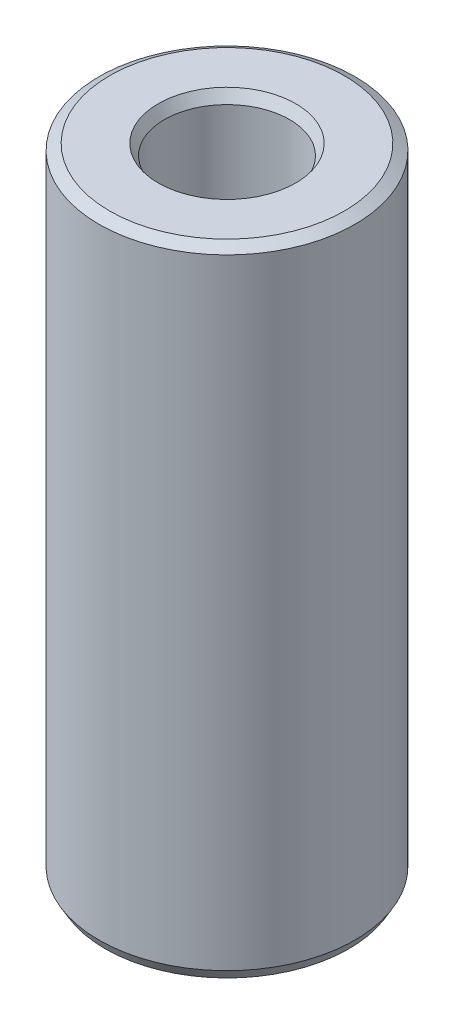
ISO-10303-21;
HEADER;
FILE_DESCRIPTION(('STEP AP214'),'2;1');
FILE_NAME('part.step','',(''),(''),'','','');
FILE_SCHEMA(('AUTOMOTIVE_DESIGN { 1 0 10303 214 1 1 1 1 }'));
ENDSEC;
DATA;
#1=APPLICATION_CONTEXT('core data for automotive mechanical design processes');
#2=APPLICATION_PROTOCOL_DEFINITION('international standard','automotive_design',2000,#1);
#3=PRODUCT_CONTEXT('',#1,'mechanical');
#4=PRODUCT('Part','Part','',(#3));
#5=PRODUCT_RELATED_PRODUCT_CATEGORY('part','',(#4));
#6=PRODUCT_DEFINITION_FORMATION('','',#4);
#7=PRODUCT_DEFINITION_CONTEXT('part definition',#1,'design');
#8=PRODUCT_DEFINITION('design','',#6,#7);
#9=PRODUCT_DEFINITION_SHAPE('','',#8);
#10=(LENGTH_UNIT() NAMED_UNIT(*) SI_UNIT(.MILLI.,.METRE.));
#11=(NAMED_UNIT(*) PLANE_ANGLE_UNIT() SI_UNIT($,.RADIAN.));
#12=(NAMED_UNIT(*) SI_UNIT($,.STERADIAN.) SOLID_ANGLE_UNIT());
#13=UNCERTAINTY_MEASURE_WITH_UNIT(LENGTH_MEASURE(1.E-05),#10,'distance_accuracy_value','');
#14=(GEOMETRIC_REPRESENTATION_CONTEXT(3) GLOBAL_UNCERTAINTY_ASSIGNED_CONTEXT((#13)) GLOBAL_UNIT_ASSIGNED_CONTEXT((#10,
#11,#12)) REPRESENTATION_CONTEXT('',''));
#15=CARTESIAN_POINT('',(0.,0.,0.));
#16=DIRECTION('',(0.,0.,1.));
#17=DIRECTION('',(1.,0.,0.));
#18=AXIS2_PLACEMENT_3D('',#15,#16,#17);
#19=CARTESIAN_POINT('',(0.,24.8775848590731,0.));
#20=DIRECTION('',(0.,-1.,0.));
#21=DIRECTION('',(0.,0.,-1.));
#22=AXIS2_PLACEMENT_3D('',#19,#20,#21);
#23=CYLINDRICAL_SURFACE('',#22,5.);
#24=CARTESIAN_POINT('',(0.,0.416492476746588,0.));
#25=DIRECTION('',(0.,1.,0.));
#26=DIRECTION('',(0.,0.,1.));
#27=AXIS2_PLACEMENT_3D('',#24,#25,#26);
#28=CIRCLE('',#27,5.);
#29=CARTESIAN_POINT('',(0.,0.416492476746588,5.));
#30=VERTEX_POINT('',#29);
#31=EDGE_CURVE('E10',#30,#30,#28,.T.);
#32=ORIENTED_EDGE('',*,*,#31,.T.);
#33=EDGE_LOOP('',(#32));
#34=FACE_BOUND('',#33,.T.);
#35=CARTESIAN_POINT('',(0.,24.637122815508,0.));
#36=DIRECTION('',(0.,1.,0.));
#37=DIRECTION('',(0.,0.,1.));
#38=AXIS2_PLACEMENT_3D('',#35,#36,#37);
#39=CIRCLE('',#38,5.);
#40=CARTESIAN_POINT('',(0.,24.637122815508,5.));
#41=VERTEX_POINT('',#40);
#42=EDGE_CURVE('E50',#41,#41,#39,.F.);
#43=ORIENTED_EDGE('',*,*,#42,.T.);
#44=EDGE_LOOP('',(#43));
#45=FACE_BOUND('',#44,.T.);
#46=ADVANCED_FACE('F39',(#34,#45),#23,.T.);
#47=CARTESIAN_POINT('',(0.,24.8775848590731,0.));
#48=DIRECTION('',(0.,1.,0.));
#49=DIRECTION('',(0.,0.,1.));
#50=AXIS2_PLACEMENT_3D('',#47,#48,#49);
#51=PLANE('',#50);
#52=CARTESIAN_POINT('',(0.,24.8775848590731,0.));
#53=DIRECTION('',(0.,1.,0.));
#54=DIRECTION('',(0.,0.,1.));
#55=AXIS2_PLACEMENT_3D('',#52,#53,#54);
#56=CIRCLE('',#55,2.68637052379127);
#57=CARTESIAN_POINT('',(0.,24.8775848590731,2.68637052379127));
#58=VERTEX_POINT('',#57);
#59=EDGE_CURVE('E58',#58,#58,#56,.F.);
#60=ORIENTED_EDGE('',*,*,#59,.T.);
#61=EDGE_LOOP('',(#60));
#62=FACE_BOUND('',#61,.T.);
#63=CARTESIAN_POINT('',(0.,24.8775848590731,0.));
#64=DIRECTION('',(0.,1.,0.));
#65=DIRECTION('',(0.,0.,1.));
#66=AXIS2_PLACEMENT_3D('',#63,#64,#65);
#67=CIRCLE('',#66,4.58350752325341);
#68=CARTESIAN_POINT('',(0.,24.8775848590731,4.58350752325341));
#69=VERTEX_POINT('',#68);
#70=EDGE_CURVE('E61',#69,#69,#67,.T.);
#71=ORIENTED_EDGE('',*,*,#70,.T.);
#72=EDGE_LOOP('',(#71));
#73=FACE_BOUND('',#72,.T.);
#74=ADVANCED_FACE('F88',(#62,#73),#51,.T.);
#75=CARTESIAN_POINT('',(0.,0.,0.));
#76=DIRECTION('',(0.,1.,0.));
#77=DIRECTION('',(0.,0.,1.));
#78=AXIS2_PLACEMENT_3D('',#75,#76,#77);
#79=PLANE('',#78);
#80=CARTESIAN_POINT('',(0.,0.,0.));
#81=DIRECTION('',(0.,1.,0.));
#82=DIRECTION('',(0.,0.,1.));
#83=AXIS2_PLACEMENT_3D('',#80,#81,#82);
#84=CIRCLE('',#83,2.86240095697276);
#85=CARTESIAN_POINT('',(0.,0.,2.86240095697276));
#86=VERTEX_POINT('',#85);
#87=EDGE_CURVE('E51',#86,#86,#84,.T.);
#88=ORIENTED_EDGE('',*,*,#87,.T.);
#89=EDGE_LOOP('',(#88));
#90=FACE_BOUND('',#89,.T.);
#91=CARTESIAN_POINT('',(0.,0.,0.));
#92=DIRECTION('',(0.,1.,0.));
#93=DIRECTION('',(0.,0.,1.));
#94=AXIS2_PLACEMENT_3D('',#91,#92,#93);
#95=CIRCLE('',#94,4.7595379564349);
#96=CARTESIAN_POINT('',(0.,0.,4.7595379564349));
#97=VERTEX_POINT('',#96);
#98=EDGE_CURVE('E54',#97,#97,#95,.F.);
#99=ORIENTED_EDGE('',*,*,#98,.T.);
#100=EDGE_LOOP('',(#99));
#101=FACE_BOUND('',#100,.T.);
#102=ADVANCED_FACE('F83',(#90,#101),#79,.F.);
#103=CARTESIAN_POINT('',(0.,24.8775848590731,0.));
#104=DIRECTION('',(0.,-1.,0.));
#105=DIRECTION('',(0.,0.,-1.));
#106=AXIS2_PLACEMENT_3D('',#103,#104,#105);
#107=CYLINDRICAL_SURFACE('',#106,2.44590848022616);
#108=CARTESIAN_POINT('',(0.,24.4610923823265,0.));
#109=DIRECTION('',(0.,1.,0.));
#110=DIRECTION('',(0.,0.,1.));
#111=AXIS2_PLACEMENT_3D('',#108,#109,#110);
#112=CIRCLE('',#111,2.44590848022616);
#113=CARTESIAN_POINT('',(0.,24.4610923823265,2.44590848022616));
#114=VERTEX_POINT('',#113);
#115=EDGE_CURVE('E67',#114,#114,#112,.T.);
#116=ORIENTED_EDGE('',*,*,#115,.T.);
#117=EDGE_LOOP('',(#116));
#118=FACE_BOUND('',#117,.T.);
#119=CARTESIAN_POINT('',(0.,0.240462043565103,0.));
#120=DIRECTION('',(0.,1.,0.));
#121=DIRECTION('',(0.,0.,1.));
#122=AXIS2_PLACEMENT_3D('',#119,#120,#121);
#123=CIRCLE('',#122,2.44590848022616);
#124=CARTESIAN_POINT('',(0.,0.240462043565103,2.44590848022616));
#125=VERTEX_POINT('',#124);
#126=EDGE_CURVE('E69',#125,#125,#123,.F.);
#127=ORIENTED_EDGE('',*,*,#126,.T.);
#128=EDGE_LOOP('',(#127));
#129=FACE_BOUND('',#128,.T.);
#130=ADVANCED_FACE('F71',(#118,#129),#107,.F.);
#131=CARTESIAN_POINT('',(0.,24.4610923823265,0.));
#132=DIRECTION('',(0.,1.,0.));
#133=DIRECTION('',(0.,0.,1.));
#134=AXIS2_PLACEMENT_3D('',#131,#132,#133);
#135=CONICAL_SURFACE('',#134,2.44590848022616,0.523598775598302);
#136=ORIENTED_EDGE('',*,*,#59,.F.);
#137=EDGE_LOOP('',(#136));
#138=FACE_BOUND('',#137,.T.);
#139=ORIENTED_EDGE('',*,*,#115,.F.);
#140=EDGE_LOOP('',(#139));
#141=FACE_BOUND('',#140,.T.);
#142=ADVANCED_FACE('F77',(#138,#141),#135,.F.);
#143=CARTESIAN_POINT('',(0.,0.,0.));
#144=DIRECTION('',(0.,-1.,0.));
#145=DIRECTION('',(0.,0.,-1.));
#146=AXIS2_PLACEMENT_3D('',#143,#144,#145);
#147=CONICAL_SURFACE('',#146,2.86240095697276,1.0471975511966);
#148=ORIENTED_EDGE('',*,*,#126,.F.);
#149=EDGE_LOOP('',(#148));
#150=FACE_BOUND('',#149,.T.);
#151=ORIENTED_EDGE('',*,*,#87,.F.);
#152=EDGE_LOOP('',(#151));
#153=FACE_BOUND('',#152,.T.);
#154=ADVANCED_FACE('F73',(#150,#153),#147,.F.);
#155=CARTESIAN_POINT('',(0.,0.416492476746588,0.));
#156=DIRECTION('',(0.,1.,0.));
#157=DIRECTION('',(0.,0.,1.));
#158=AXIS2_PLACEMENT_3D('',#155,#156,#157);
#159=CONICAL_SURFACE('',#158,5.,0.523598775598304);
#160=CARTESIAN_POINT('',(0.,0.,4.7595379564349));
#161=CARTESIAN_POINT('',(0.,0.00433846329944348,4.7620427693887));
#162=CARTESIAN_POINT('',(0.,0.00867692659888714,4.76454758234251));
#163=CARTESIAN_POINT('',(0.,0.0173538531977745,4.76955720825011));
#164=CARTESIAN_POINT('',(0.,0.0216923164972181,4.77206202120392));
#165=CARTESIAN_POINT('',(0.,0.0303692430961053,4.77707164711152));
#166=CARTESIAN_POINT('',(0.,0.0347077063955489,4.77957646006533));
#167=CARTESIAN_POINT('',(0.,0.0433846329944361,4.78458608597293));
#168=CARTESIAN_POINT('',(0.,0.0477230962938798,4.78709089892674));
#169=CARTESIAN_POINT('',(0.,0.056400022892767,4.79210052483434));
#170=CARTESIAN_POINT('',(0.,0.0607384861922106,4.79460533778814));
#171=CARTESIAN_POINT('',(0.,0.0694154127910979,4.79961496369575));
#172=CARTESIAN_POINT('',(0.,0.0737538760905415,4.80211977664955));
#173=CARTESIAN_POINT('',(0.,0.0824308026894288,4.80712940255716));
#174=CARTESIAN_POINT('',(0.,0.0867692659888724,4.80963421551096));
#175=CARTESIAN_POINT('',(0.,0.0954461925877596,4.81464384141857));
#176=CARTESIAN_POINT('',(0.,0.0997846558872032,4.81714865437237));
#177=CARTESIAN_POINT('',(0.,0.10846158248609,4.82215828027998));
#178=CARTESIAN_POINT('',(0.,0.112800045785534,4.82466309323378));
#179=CARTESIAN_POINT('',(0.,0.121476972384421,4.82967271914139));
#180=CARTESIAN_POINT('',(0.,0.125815435683865,4.83217753209519));
#181=CARTESIAN_POINT('',(0.,0.134492362282752,4.8371871580028));
#182=CARTESIAN_POINT('',(0.,0.138830825582196,4.8396919709566));
#183=CARTESIAN_POINT('',(0.,0.147507752181083,4.84470159686421));
#184=CARTESIAN_POINT('',(0.,0.151846215480527,4.84720640981801));
#185=CARTESIAN_POINT('',(0.,0.160523142079414,4.85221603572562));
#186=CARTESIAN_POINT('',(0.,0.164861605378858,4.85472084867942));
#187=CARTESIAN_POINT('',(0.,0.173538531977745,4.85973047458703));
#188=CARTESIAN_POINT('',(0.,0.177876995277188,4.86223528754083));
#189=CARTESIAN_POINT('',(0.,0.186553921876076,4.86724491344843));
#190=CARTESIAN_POINT('',(0.,0.190892385175519,4.86974972640224));
#191=CARTESIAN_POINT('',(0.,0.199569311774407,4.87475935230984));
#192=CARTESIAN_POINT('',(0.,0.20390777507385,4.87726416526365));
#193=CARTESIAN_POINT('',(0.,0.212584701672737,4.88227379117125));
#194=CARTESIAN_POINT('',(0.,0.216923164972181,4.88477860412506));
#195=CARTESIAN_POINT('',(0.,0.225600091571068,4.88978823003266));
#196=CARTESIAN_POINT('',(0.,0.229938554870512,4.89229304298647));
#197=CARTESIAN_POINT('',(0.,0.238615481469399,4.89730266889407));
#198=CARTESIAN_POINT('',(0.,0.242953944768843,4.89980748184788));
#199=CARTESIAN_POINT('',(0.,0.25163087136773,4.90481710775548));
#200=CARTESIAN_POINT('',(0.,0.255969334667174,4.90732192070929));
#201=CARTESIAN_POINT('',(0.,0.264646261266061,4.91233154661689));
#202=CARTESIAN_POINT('',(0.,0.268984724565504,4.91483635957069));
#203=CARTESIAN_POINT('',(0.,0.277661651164392,4.9198459854783));
#204=CARTESIAN_POINT('',(0.,0.282000114463835,4.9223507984321));
#205=CARTESIAN_POINT('',(0.,0.290677041062723,4.92736042433971));
#206=CARTESIAN_POINT('',(0.,0.295015504362166,4.92986523729351));
#207=CARTESIAN_POINT('',(0.,0.303692430961053,4.93487486320112));
#208=CARTESIAN_POINT('',(0.,0.308030894260497,4.93737967615492));
#209=CARTESIAN_POINT('',(0.,0.316707820859384,4.94238930206253));
#210=CARTESIAN_POINT('',(0.,0.321046284158828,4.94489411501633));
#211=CARTESIAN_POINT('',(0.,0.329723210757715,4.94990374092394));
#212=CARTESIAN_POINT('',(0.,0.334061674057159,4.95240855387774));
#213=CARTESIAN_POINT('',(0.,0.342738600656046,4.95741817978535));
#214=CARTESIAN_POINT('',(0.,0.34707706395549,4.95992299273915));
#215=CARTESIAN_POINT('',(0.,0.355753990554377,4.96493261864676));
#216=CARTESIAN_POINT('',(0.,0.36009245385382,4.96743743160056));
#217=CARTESIAN_POINT('',(0.,0.368769380452708,4.97244705750817));
#218=CARTESIAN_POINT('',(0.,0.373107843752151,4.97495187046197));
#219=CARTESIAN_POINT('',(0.,0.381784770351039,4.97996149636958));
#220=CARTESIAN_POINT('',(0.,0.386123233650482,4.98246630932338));
#221=CARTESIAN_POINT('',(0.,0.394800160249369,4.98747593523099));
#222=CARTESIAN_POINT('',(0.,0.399138623548813,4.98998074818479));
#223=CARTESIAN_POINT('',(0.,0.4078155501477,4.99499037409239));
#224=CARTESIAN_POINT('',(0.,0.412154013447144,4.9974951870462));
#225=CARTESIAN_POINT('',(0.,0.416492476746588,5.));
#226=B_SPLINE_CURVE_WITH_KNOTS('',3,(#160,#161,#162,#163,#164,#165,#166,#167,#168,#169,#170,
#171,#172,#173,#174,#175,#176,#177,#178,#179,#180,#181,#182,#183,#184,#185,#186,#187,#188,#189,
#190,#191,#192,#193,#194,#195,#196,#197,#198,#199,#200,#201,#202,#203,#204,#205,#206,#207,#208,
#209,#210,#211,#212,#213,#214,#215,#216,#217,#218,#219,#220,#221,#222,#223,#224,#225),
.UNSPECIFIED.,.F.,.F.,(4,2,2,2,2,2,2,2,2,2,2,2,2,2,2,2,2,2,2,2,2,2,2,2,2,2,2,2,2,2,2,2,4),(0.,
0.0150288777228185,0.0300577554456369,0.0450866331684558,0.0601155108912743,0.0751443886140928,
0.0901732663369112,0.10520214405973,0.120231021782549,0.135259899505367,0.150288777228186,
0.165317654951004,0.180346532673823,0.195375410396641,0.21040428811946,0.225433165842278,
0.240462043565097,0.255490921287916,0.270519799010734,0.285548676733553,0.300577554456371,
0.31560643217919,0.330635309902008,0.345664187624827,0.360693065347645,0.375721943070464,
0.390750820793283,0.405779698516101,0.42080857623892,0.435837453961738,0.450866331684557,
0.465895209407375,0.480924087130194),.UNSPECIFIED.);
#227=EDGE_CURVE('BSEAM76',#97,#30,#226,.T.);
#228=ORIENTED_EDGE('',*,*,#98,.F.);
#229=ORIENTED_EDGE('',*,*,#31,.F.);
#230=ORIENTED_EDGE('',*,*,#227,.T.);
#231=ORIENTED_EDGE('',*,*,#227,.F.);
#232=EDGE_LOOP('',(#228,#230,#229,#231));
#233=FACE_BOUND('',#232,.T.);
#234=ADVANCED_FACE('F76',(#233),#159,.T.);
#235=CARTESIAN_POINT('',(0.,24.8775848590731,0.));
#236=DIRECTION('',(0.,-1.,0.));
#237=DIRECTION('',(0.,0.,-1.));
#238=AXIS2_PLACEMENT_3D('',#235,#236,#237);
#239=CONICAL_SURFACE('',#238,4.58350752325341,1.04719755119659);
#240=ORIENTED_EDGE('',*,*,#42,.F.);
#241=EDGE_LOOP('',(#240));
#242=FACE_BOUND('',#241,.T.);
#243=ORIENTED_EDGE('',*,*,#70,.F.);
#244=EDGE_LOOP('',(#243));
#245=FACE_BOUND('',#244,.T.);
#246=ADVANCED_FACE('F45',(#242,#245),#239,.T.);
#247=CLOSED_SHELL('',(#46,#74,#102,#130,#142,#154,#234,#246));
#248=MANIFOLD_SOLID_BREP('B2',#247);
#249=ADVANCED_BREP_SHAPE_REPRESENTATION('',(#18,#248),#14);
#250=SHAPE_DEFINITION_REPRESENTATION(#9,#249);
ENDSEC;
END-ISO-10303-21;
